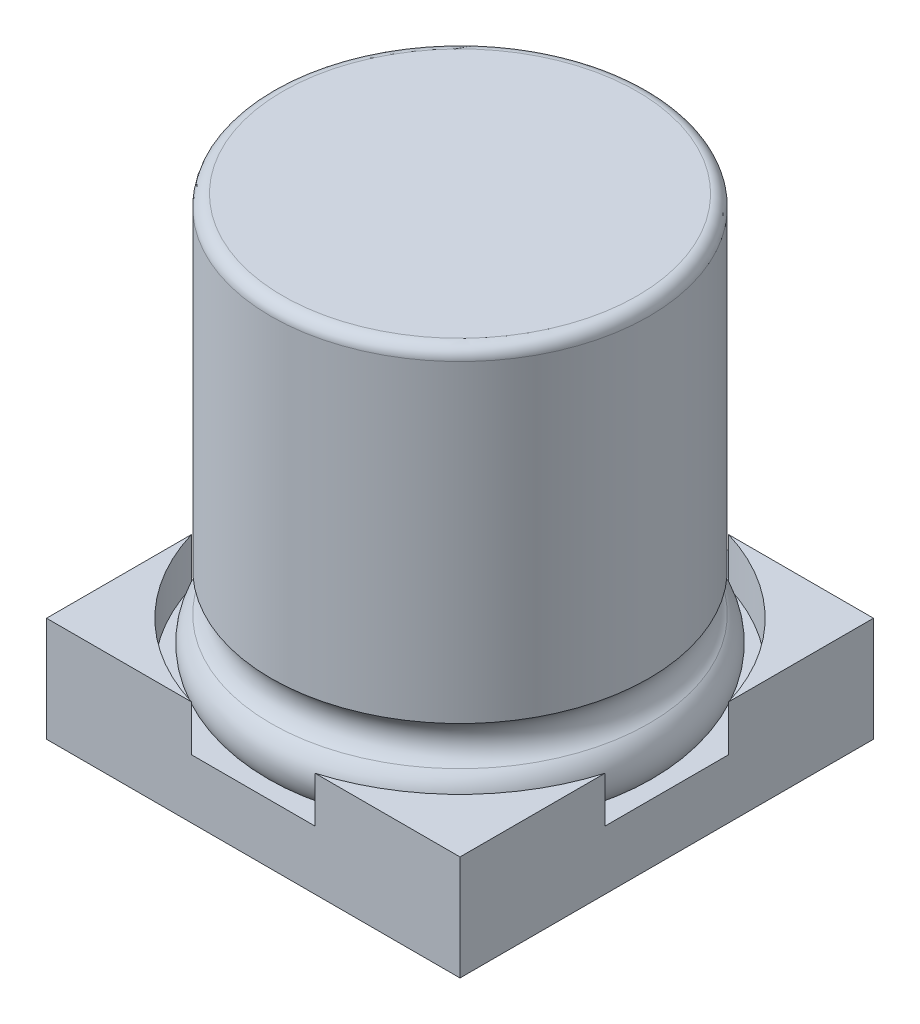
ISO-10303-21;
HEADER;
FILE_DESCRIPTION(('STEP AP214'),'2;1');
FILE_NAME('part.step','',(''),(''),'','','');
FILE_SCHEMA(('AUTOMOTIVE_DESIGN { 1 0 10303 214 1 1 1 1 }'));
ENDSEC;
DATA;
#1=APPLICATION_CONTEXT('core data for automotive mechanical design processes');
#2=APPLICATION_PROTOCOL_DEFINITION('international standard','automotive_design',2000,#1);
#3=PRODUCT_CONTEXT('',#1,'mechanical');
#4=PRODUCT('Part','Part','',(#3));
#5=PRODUCT_RELATED_PRODUCT_CATEGORY('part','',(#4));
#6=PRODUCT_DEFINITION_FORMATION('','',#4);
#7=PRODUCT_DEFINITION_CONTEXT('part definition',#1,'design');
#8=PRODUCT_DEFINITION('design','',#6,#7);
#9=PRODUCT_DEFINITION_SHAPE('','',#8);
#10=(LENGTH_UNIT() NAMED_UNIT(*) SI_UNIT(.MILLI.,.METRE.));
#11=(NAMED_UNIT(*) PLANE_ANGLE_UNIT() SI_UNIT($,.RADIAN.));
#12=(NAMED_UNIT(*) SI_UNIT($,.STERADIAN.) SOLID_ANGLE_UNIT());
#13=UNCERTAINTY_MEASURE_WITH_UNIT(LENGTH_MEASURE(1.E-05),#10,'distance_accuracy_value','');
#14=(GEOMETRIC_REPRESENTATION_CONTEXT(3) GLOBAL_UNCERTAINTY_ASSIGNED_CONTEXT((#13)) GLOBAL_UNIT_ASSIGNED_CONTEXT((#10,
#11,#12)) REPRESENTATION_CONTEXT('',''));
#15=CARTESIAN_POINT('',(0.,0.,0.));
#16=DIRECTION('',(0.,0.,1.));
#17=DIRECTION('',(1.,0.,0.));
#18=AXIS2_PLACEMENT_3D('',#15,#16,#17);
#19=CARTESIAN_POINT('',(0.,0.2,-4.6380085368));
#20=DIRECTION('',(0.,0.,-1.));
#21=DIRECTION('',(-1.,0.,0.));
#22=AXIS2_PLACEMENT_3D('',#19,#20,#21);
#23=PLANE('',#22);
#24=DIRECTION('',(1.,0.,0.));
#25=VECTOR('',#24,1.);
#26=CARTESIAN_POINT('',(-0.6,0.4,-4.6380085368));
#27=LINE('',#26,#25);
#28=CARTESIAN_POINT('',(0.6,0.4,-4.6380085368));
#29=VERTEX_POINT('',#28);
#30=CARTESIAN_POINT('',(-0.6,0.4,-4.6380085368));
#31=VERTEX_POINT('',#30);
#32=EDGE_CURVE('E129',#29,#31,#27,.F.);
#33=ORIENTED_EDGE('',*,*,#32,.F.);
#34=DIRECTION('',(0.,1.,0.));
#35=VECTOR('',#34,1.);
#36=CARTESIAN_POINT('',(0.6,0.4,-4.6380085368));
#37=LINE('',#36,#35);
#38=CARTESIAN_POINT('',(0.6,0.,-4.6380085368));
#39=VERTEX_POINT('',#38);
#40=EDGE_CURVE('E136',#39,#29,#37,.T.);
#41=ORIENTED_EDGE('',*,*,#40,.F.);
#42=DIRECTION('',(1.,0.,0.));
#43=VECTOR('',#42,1.);
#44=CARTESIAN_POINT('',(0.,0.,-4.6380085368));
#45=LINE('',#44,#43);
#46=CARTESIAN_POINT('',(-0.6,0.,-4.6380085368));
#47=VERTEX_POINT('',#46);
#48=EDGE_CURVE('E132',#39,#47,#45,.F.);
#49=ORIENTED_EDGE('',*,*,#48,.T.);
#50=DIRECTION('',(0.,1.,0.));
#51=VECTOR('',#50,1.);
#52=CARTESIAN_POINT('',(-0.6,0.,-4.6380085368));
#53=LINE('',#52,#51);
#54=EDGE_CURVE('E126',#31,#47,#53,.F.);
#55=ORIENTED_EDGE('',*,*,#54,.F.);
#56=EDGE_LOOP('',(#33,#41,#49,#55));
#57=FACE_BOUND('',#56,.T.);
#58=ADVANCED_FACE('F17',(#57),#23,.T.);
#59=CARTESIAN_POINT('',(-0.6,0.,-3.5));
#60=DIRECTION('',(-1.,0.,0.));
#61=DIRECTION('',(0.,0.,1.));
#62=AXIS2_PLACEMENT_3D('',#59,#60,#61);
#63=PLANE('',#62);
#64=ORIENTED_EDGE('',*,*,#54,.T.);
#65=DIRECTION('',(0.,0.,1.));
#66=VECTOR('',#65,1.);
#67=CARTESIAN_POINT('',(-0.6,0.,0.));
#68=LINE('',#67,#66);
#69=CARTESIAN_POINT('',(-0.6,0.,-3.5));
#70=VERTEX_POINT('',#69);
#71=EDGE_CURVE('E210',#47,#70,#68,.T.);
#72=ORIENTED_EDGE('',*,*,#71,.T.);
#73=DIRECTION('',(0.,1.,0.));
#74=VECTOR('',#73,1.);
#75=CARTESIAN_POINT('',(-0.6,0.,-3.5));
#76=LINE('',#75,#74);
#77=CARTESIAN_POINT('',(-0.6,0.4,-3.5));
#78=VERTEX_POINT('',#77);
#79=EDGE_CURVE('E142',#78,#70,#76,.F.);
#80=ORIENTED_EDGE('',*,*,#79,.F.);
#81=DIRECTION('',(0.,0.,1.));
#82=VECTOR('',#81,1.);
#83=CARTESIAN_POINT('',(-0.6,0.4,-3.5));
#84=LINE('',#83,#82);
#85=EDGE_CURVE('E139',#31,#78,#84,.T.);
#86=ORIENTED_EDGE('',*,*,#85,.F.);
#87=EDGE_LOOP('',(#64,#72,#80,#86));
#88=FACE_BOUND('',#87,.T.);
#89=ADVANCED_FACE('F140',(#88),#63,.T.);
#90=CARTESIAN_POINT('',(0.6,0.4,-3.5));
#91=DIRECTION('',(1.,0.,0.));
#92=DIRECTION('',(0.,0.,-1.));
#93=AXIS2_PLACEMENT_3D('',#90,#91,#92);
#94=PLANE('',#93);
#95=ORIENTED_EDGE('',*,*,#40,.T.);
#96=DIRECTION('',(0.,0.,1.));
#97=VECTOR('',#96,1.);
#98=CARTESIAN_POINT('',(0.6,0.4,-3.5));
#99=LINE('',#98,#97);
#100=CARTESIAN_POINT('',(0.6,0.4,-3.5));
#101=VERTEX_POINT('',#100);
#102=EDGE_CURVE('E149',#101,#29,#99,.F.);
#103=ORIENTED_EDGE('',*,*,#102,.F.);
#104=DIRECTION('',(0.,1.,0.));
#105=VECTOR('',#104,1.);
#106=CARTESIAN_POINT('',(0.6,0.,-3.5));
#107=LINE('',#106,#105);
#108=CARTESIAN_POINT('',(0.6,0.,-3.5));
#109=VERTEX_POINT('',#108);
#110=EDGE_CURVE('E196',#109,#101,#107,.T.);
#111=ORIENTED_EDGE('',*,*,#110,.F.);
#112=DIRECTION('',(0.,0.,1.));
#113=VECTOR('',#112,1.);
#114=CARTESIAN_POINT('',(0.6,0.,0.));
#115=LINE('',#114,#113);
#116=EDGE_CURVE('E211',#109,#39,#115,.F.);
#117=ORIENTED_EDGE('',*,*,#116,.T.);
#118=EDGE_LOOP('',(#95,#103,#111,#117));
#119=FACE_BOUND('',#118,.T.);
#120=ADVANCED_FACE('F215',(#119),#94,.T.);
#121=CARTESIAN_POINT('',(-0.6,0.4,-3.5));
#122=DIRECTION('',(0.,1.,0.));
#123=DIRECTION('',(0.,0.,1.));
#124=AXIS2_PLACEMENT_3D('',#121,#122,#123);
#125=PLANE('',#124);
#126=ORIENTED_EDGE('',*,*,#32,.T.);
#127=ORIENTED_EDGE('',*,*,#85,.T.);
#128=DIRECTION('',(-1.,0.,0.));
#129=VECTOR('',#128,1.);
#130=CARTESIAN_POINT('',(3.5,0.4,-3.5));
#131=LINE('',#130,#129);
#132=EDGE_CURVE('E190',#101,#78,#131,.T.);
#133=ORIENTED_EDGE('',*,*,#132,.F.);
#134=ORIENTED_EDGE('',*,*,#102,.T.);
#135=EDGE_LOOP('',(#126,#127,#133,#134));
#136=FACE_BOUND('',#135,.T.);
#137=ADVANCED_FACE('F148',(#136),#125,.T.);
#138=CARTESIAN_POINT('',(-2.27357437807846,1.775,-2.27357437807846));
#139=DIRECTION('',(0.,1.,0.));
#140=DIRECTION('',(0.,0.,1.));
#141=AXIS2_PLACEMENT_3D('',#138,#139,#140);
#142=PLANE('',#141);
#143=DIRECTION('',(0.,0.,1.));
#144=VECTOR('',#143,1.);
#145=CARTESIAN_POINT('',(-3.5,1.775,-2.27357437807846));
#146=LINE('',#145,#144);
#147=CARTESIAN_POINT('',(-3.5,1.775,-2.268));
#148=VERTEX_POINT('',#147);
#149=CARTESIAN_POINT('',(-3.5,1.775,-1.04714875615693));
#150=VERTEX_POINT('',#149);
#151=EDGE_CURVE('E146',#148,#150,#146,.T.);
#152=ORIENTED_EDGE('',*,*,#151,.T.);
#153=CARTESIAN_POINT('',(0.,1.775,0.));
#154=DIRECTION('',(0.,1.,0.));
#155=DIRECTION('',(0.,0.,1.));
#156=AXIS2_PLACEMENT_3D('',#153,#154,#155);
#157=CIRCLE('',#156,3.653289);
#158=CARTESIAN_POINT('',(-1.04714875615693,1.775,-3.5));
#159=VERTEX_POINT('',#158);
#160=EDGE_CURVE('E188',#150,#159,#157,.F.);
#161=ORIENTED_EDGE('',*,*,#160,.T.);
#162=DIRECTION('',(-1.,0.,0.));
#163=VECTOR('',#162,1.);
#164=CARTESIAN_POINT('',(3.5,1.775,-3.5));
#165=LINE('',#164,#163);
#166=CARTESIAN_POINT('',(-2.268,1.775,-3.5));
#167=VERTEX_POINT('',#166);
#168=EDGE_CURVE('E315',#167,#159,#165,.F.);
#169=ORIENTED_EDGE('',*,*,#168,.F.);
#170=DIRECTION('',(-0.707106781186547,0.,0.707106781186548));
#171=VECTOR('',#170,1.);
#172=CARTESIAN_POINT('',(-2.884,1.775,-2.884));
#173=LINE('',#172,#171);
#174=EDGE_CURVE('E99',#148,#167,#173,.F.);
#175=ORIENTED_EDGE('',*,*,#174,.F.);
#176=EDGE_LOOP('',(#152,#161,#169,#175));
#177=FACE_BOUND('',#176,.T.);
#178=ADVANCED_FACE('F341',(#177),#142,.T.);
#179=CARTESIAN_POINT('',(-2.884,0.,-2.884));
#180=DIRECTION('',(-0.707106781186548,0.,-0.707106781186547));
#181=DIRECTION('',(-0.707106781186547,0.,0.707106781186548));
#182=AXIS2_PLACEMENT_3D('',#179,#180,#181);
#183=PLANE('',#182);
#184=DIRECTION('',(0.,1.,0.));
#185=VECTOR('',#184,1.);
#186=CARTESIAN_POINT('',(-3.5,0.,-2.268));
#187=LINE('',#186,#185);
#188=CARTESIAN_POINT('',(-3.5,0.,-2.268));
#189=VERTEX_POINT('',#188);
#190=EDGE_CURVE('E194',#148,#189,#187,.F.);
#191=ORIENTED_EDGE('',*,*,#190,.F.);
#192=ORIENTED_EDGE('',*,*,#174,.T.);
#193=DIRECTION('',(0.,1.,0.));
#194=VECTOR('',#193,1.);
#195=CARTESIAN_POINT('',(-2.268,0.,-3.5));
#196=LINE('',#195,#194);
#197=CARTESIAN_POINT('',(-2.268,0.,-3.5));
#198=VERTEX_POINT('',#197);
#199=EDGE_CURVE('E237',#198,#167,#196,.T.);
#200=ORIENTED_EDGE('',*,*,#199,.F.);
#201=DIRECTION('',(-0.707106781186548,0.,0.707106781186548));
#202=VECTOR('',#201,1.);
#203=CARTESIAN_POINT('',(-2.268,0.,-3.5));
#204=LINE('',#203,#202);
#205=EDGE_CURVE('E225',#198,#189,#204,.T.);
#206=ORIENTED_EDGE('',*,*,#205,.T.);
#207=EDGE_LOOP('',(#191,#192,#200,#206));
#208=FACE_BOUND('',#207,.T.);
#209=ADVANCED_FACE('F331',(#208),#183,.T.);
#210=CARTESIAN_POINT('',(-2.27357437807847,1.775,2.27357437807846));
#211=DIRECTION('',(0.,1.,0.));
#212=DIRECTION('',(0.,0.,1.));
#213=AXIS2_PLACEMENT_3D('',#210,#211,#212);
#214=PLANE('',#213);
#215=DIRECTION('',(1.,0.,0.));
#216=VECTOR('',#215,1.);
#217=CARTESIAN_POINT('',(-3.5,1.775,3.5));
#218=LINE('',#217,#216);
#219=CARTESIAN_POINT('',(-1.04714875615693,1.775,3.5));
#220=VERTEX_POINT('',#219);
#221=CARTESIAN_POINT('',(-3.5,1.775,3.5));
#222=VERTEX_POINT('',#221);
#223=EDGE_CURVE('E286',#220,#222,#218,.F.);
#224=ORIENTED_EDGE('',*,*,#223,.F.);
#225=CARTESIAN_POINT('',(0.,1.775,0.));
#226=DIRECTION('',(0.,1.,0.));
#227=DIRECTION('',(0.,0.,1.));
#228=AXIS2_PLACEMENT_3D('',#225,#226,#227);
#229=CIRCLE('',#228,3.653289);
#230=CARTESIAN_POINT('',(-3.5,1.775,1.04714875615693));
#231=VERTEX_POINT('',#230);
#232=EDGE_CURVE('E185',#220,#231,#229,.F.);
#233=ORIENTED_EDGE('',*,*,#232,.T.);
#234=DIRECTION('',(0.,0.,1.));
#235=VECTOR('',#234,1.);
#236=CARTESIAN_POINT('',(-3.5,1.775,-3.5));
#237=LINE('',#236,#235);
#238=EDGE_CURVE('E296',#222,#231,#237,.F.);
#239=ORIENTED_EDGE('',*,*,#238,.F.);
#240=EDGE_LOOP('',(#224,#233,#239));
#241=FACE_BOUND('',#240,.T.);
#242=ADVANCED_FACE('F349',(#241),#214,.T.);
#243=CARTESIAN_POINT('',(0.,0.,0.));
#244=DIRECTION('',(0.,1.,0.));
#245=DIRECTION('',(0.,0.,1.));
#246=AXIS2_PLACEMENT_3D('',#243,#244,#245);
#247=PLANE('',#246);
#248=DIRECTION('',(-1.,0.,0.));
#249=VECTOR('',#248,1.);
#250=CARTESIAN_POINT('',(3.5,0.,-3.5));
#251=LINE('',#250,#249);
#252=EDGE_CURVE('E224',#70,#198,#251,.T.);
#253=ORIENTED_EDGE('',*,*,#252,.F.);
#254=ORIENTED_EDGE('',*,*,#71,.F.);
#255=ORIENTED_EDGE('',*,*,#48,.F.);
#256=ORIENTED_EDGE('',*,*,#116,.F.);
#257=DIRECTION('',(-1.,0.,0.));
#258=VECTOR('',#257,1.);
#259=CARTESIAN_POINT('',(3.5,0.,-3.5));
#260=LINE('',#259,#258);
#261=CARTESIAN_POINT('',(3.5,0.,-3.5));
#262=VERTEX_POINT('',#261);
#263=EDGE_CURVE('E200',#262,#109,#260,.T.);
#264=ORIENTED_EDGE('',*,*,#263,.F.);
#265=DIRECTION('',(0.,0.,-1.));
#266=VECTOR('',#265,1.);
#267=CARTESIAN_POINT('',(3.5,0.,3.5));
#268=LINE('',#267,#266);
#269=CARTESIAN_POINT('',(3.5,0.,3.5));
#270=VERTEX_POINT('',#269);
#271=EDGE_CURVE('E260',#270,#262,#268,.T.);
#272=ORIENTED_EDGE('',*,*,#271,.F.);
#273=DIRECTION('',(1.,0.,0.));
#274=VECTOR('',#273,1.);
#275=CARTESIAN_POINT('',(-3.5,0.,3.5));
#276=LINE('',#275,#274);
#277=CARTESIAN_POINT('',(-3.5,0.,3.5));
#278=VERTEX_POINT('',#277);
#279=EDGE_CURVE('E280',#278,#270,#276,.T.);
#280=ORIENTED_EDGE('',*,*,#279,.F.);
#281=DIRECTION('',(0.,0.,1.));
#282=VECTOR('',#281,1.);
#283=CARTESIAN_POINT('',(-3.5,0.,-3.5));
#284=LINE('',#283,#282);
#285=EDGE_CURVE('E299',#189,#278,#284,.T.);
#286=ORIENTED_EDGE('',*,*,#285,.F.);
#287=ORIENTED_EDGE('',*,*,#205,.F.);
#288=EDGE_LOOP('',(#253,#254,#255,#256,#264,#272,#280,#286,#287));
#289=FACE_BOUND('',#288,.T.);
#290=ADVANCED_FACE('F222',(#289),#247,.F.);
#291=CARTESIAN_POINT('',(2.27357437807847,1.775,-2.27357437807847));
#292=DIRECTION('',(0.,1.,0.));
#293=DIRECTION('',(0.,0.,1.));
#294=AXIS2_PLACEMENT_3D('',#291,#292,#293);
#295=PLANE('',#294);
#296=DIRECTION('',(-1.,0.,0.));
#297=VECTOR('',#296,1.);
#298=CARTESIAN_POINT('',(3.5,1.775,-3.5));
#299=LINE('',#298,#297);
#300=CARTESIAN_POINT('',(1.04714875615693,1.775,-3.5));
#301=VERTEX_POINT('',#300);
#302=CARTESIAN_POINT('',(3.5,1.775,-3.5));
#303=VERTEX_POINT('',#302);
#304=EDGE_CURVE('E246',#301,#303,#299,.F.);
#305=ORIENTED_EDGE('',*,*,#304,.F.);
#306=CARTESIAN_POINT('',(0.,1.775,0.));
#307=DIRECTION('',(0.,1.,0.));
#308=DIRECTION('',(0.,0.,1.));
#309=AXIS2_PLACEMENT_3D('',#306,#307,#308);
#310=CIRCLE('',#309,3.653289);
#311=CARTESIAN_POINT('',(3.5,1.775,-1.04714875615693));
#312=VERTEX_POINT('',#311);
#313=EDGE_CURVE('E20',#301,#312,#310,.F.);
#314=ORIENTED_EDGE('',*,*,#313,.T.);
#315=DIRECTION('',(0.,0.,-1.));
#316=VECTOR('',#315,1.);
#317=CARTESIAN_POINT('',(3.5,1.775,3.5));
#318=LINE('',#317,#316);
#319=EDGE_CURVE('E243',#303,#312,#318,.F.);
#320=ORIENTED_EDGE('',*,*,#319,.F.);
#321=EDGE_LOOP('',(#305,#314,#320));
#322=FACE_BOUND('',#321,.T.);
#323=ADVANCED_FACE('F240',(#322),#295,.T.);
#324=CARTESIAN_POINT('',(2.27357437807847,1.775,2.27357437807847));
#325=DIRECTION('',(0.,1.,0.));
#326=DIRECTION('',(0.,0.,1.));
#327=AXIS2_PLACEMENT_3D('',#324,#325,#326);
#328=PLANE('',#327);
#329=DIRECTION('',(0.,0.,-1.));
#330=VECTOR('',#329,1.);
#331=CARTESIAN_POINT('',(3.5,1.775,3.5));
#332=LINE('',#331,#330);
#333=CARTESIAN_POINT('',(3.5,1.775,1.04714875615693));
#334=VERTEX_POINT('',#333);
#335=CARTESIAN_POINT('',(3.5,1.775,3.5));
#336=VERTEX_POINT('',#335);
#337=EDGE_CURVE('E421',#334,#336,#332,.F.);
#338=ORIENTED_EDGE('',*,*,#337,.F.);
#339=CARTESIAN_POINT('',(0.,1.775,0.));
#340=DIRECTION('',(0.,1.,0.));
#341=DIRECTION('',(0.,0.,1.));
#342=AXIS2_PLACEMENT_3D('',#339,#340,#341);
#343=CIRCLE('',#342,3.653289);
#344=CARTESIAN_POINT('',(1.04714875615693,1.775,3.5));
#345=VERTEX_POINT('',#344);
#346=EDGE_CURVE('E181',#334,#345,#343,.F.);
#347=ORIENTED_EDGE('',*,*,#346,.T.);
#348=DIRECTION('',(1.,0.,0.));
#349=VECTOR('',#348,1.);
#350=CARTESIAN_POINT('',(-3.5,1.775,3.5));
#351=LINE('',#350,#349);
#352=EDGE_CURVE('E283',#336,#345,#351,.F.);
#353=ORIENTED_EDGE('',*,*,#352,.F.);
#354=EDGE_LOOP('',(#338,#347,#353));
#355=FACE_BOUND('',#354,.T.);
#356=ADVANCED_FACE('F462',(#355),#328,.T.);
#357=CARTESIAN_POINT('',(0.,1.,0.));
#358=DIRECTION('',(0.,1.,0.));
#359=DIRECTION('',(0.,0.,1.));
#360=AXIS2_PLACEMENT_3D('',#357,#358,#359);
#361=CYLINDRICAL_SURFACE('',#360,3.653289);
#362=DIRECTION('',(0.,1.,0.));
#363=VECTOR('',#362,1.);
#364=CARTESIAN_POINT('',(3.5,0.,-1.04714875615693));
#365=LINE('',#364,#363);
#366=CARTESIAN_POINT('',(3.5,1.,-1.04714875615693));
#367=VERTEX_POINT('',#366);
#368=EDGE_CURVE('E249',#312,#367,#365,.F.);
#369=ORIENTED_EDGE('',*,*,#368,.F.);
#370=ORIENTED_EDGE('',*,*,#313,.F.);
#371=DIRECTION('',(0.,1.,0.));
#372=VECTOR('',#371,1.);
#373=CARTESIAN_POINT('',(1.04714875615693,0.,-3.5));
#374=LINE('',#373,#372);
#375=CARTESIAN_POINT('',(1.04714875615693,1.,-3.5));
#376=VERTEX_POINT('',#375);
#377=EDGE_CURVE('E271',#376,#301,#374,.T.);
#378=ORIENTED_EDGE('',*,*,#377,.F.);
#379=CARTESIAN_POINT('',(0.,1.,0.));
#380=DIRECTION('',(0.,1.,0.));
#381=DIRECTION('',(0.,0.,1.));
#382=AXIS2_PLACEMENT_3D('',#379,#380,#381);
#383=CIRCLE('',#382,3.653289);
#384=EDGE_CURVE('E177',#367,#376,#383,.T.);
#385=ORIENTED_EDGE('',*,*,#384,.F.);
#386=EDGE_LOOP('',(#369,#370,#378,#385));
#387=FACE_BOUND('',#386,.T.);
#388=ADVANCED_FACE('F250',(#387),#361,.F.);
#389=CARTESIAN_POINT('',(3.5,0.,-3.5));
#390=DIRECTION('',(0.,0.,-1.));
#391=DIRECTION('',(-1.,0.,0.));
#392=AXIS2_PLACEMENT_3D('',#389,#390,#391);
#393=PLANE('',#392);
#394=ORIENTED_EDGE('',*,*,#110,.T.);
#395=ORIENTED_EDGE('',*,*,#132,.T.);
#396=ORIENTED_EDGE('',*,*,#79,.T.);
#397=ORIENTED_EDGE('',*,*,#252,.T.);
#398=ORIENTED_EDGE('',*,*,#199,.T.);
#399=ORIENTED_EDGE('',*,*,#168,.T.);
#400=DIRECTION('',(0.,1.,0.));
#401=VECTOR('',#400,1.);
#402=CARTESIAN_POINT('',(-1.04714875615693,1.,-3.5));
#403=LINE('',#402,#401);
#404=CARTESIAN_POINT('',(-1.04714875615693,1.,-3.5));
#405=VERTEX_POINT('',#404);
#406=EDGE_CURVE('E189',#159,#405,#403,.F.);
#407=ORIENTED_EDGE('',*,*,#406,.T.);
#408=DIRECTION('',(1.,0.,0.));
#409=VECTOR('',#408,1.);
#410=CARTESIAN_POINT('',(0.,1.,-3.5));
#411=LINE('',#410,#409);
#412=EDGE_CURVE('E176',#376,#405,#411,.F.);
#413=ORIENTED_EDGE('',*,*,#412,.F.);
#414=ORIENTED_EDGE('',*,*,#377,.T.);
#415=ORIENTED_EDGE('',*,*,#304,.T.);
#416=DIRECTION('',(0.,1.,0.));
#417=VECTOR('',#416,1.);
#418=CARTESIAN_POINT('',(3.5,0.,-3.5));
#419=LINE('',#418,#417);
#420=EDGE_CURVE('E258',#262,#303,#419,.T.);
#421=ORIENTED_EDGE('',*,*,#420,.F.);
#422=ORIENTED_EDGE('',*,*,#263,.T.);
#423=EDGE_LOOP('',(#394,#395,#396,#397,#398,#399,#407,#413,#414,#415,#421,#422));
#424=FACE_BOUND('',#423,.T.);
#425=ADVANCED_FACE('F329',(#424),#393,.T.);
#426=CARTESIAN_POINT('',(0.,1.,0.));
#427=DIRECTION('',(0.,1.,0.));
#428=DIRECTION('',(0.,0.,1.));
#429=AXIS2_PLACEMENT_3D('',#426,#427,#428);
#430=CYLINDRICAL_SURFACE('',#429,3.653289);
#431=ORIENTED_EDGE('',*,*,#406,.F.);
#432=ORIENTED_EDGE('',*,*,#160,.F.);
#433=DIRECTION('',(0.,1.,0.));
#434=VECTOR('',#433,1.);
#435=CARTESIAN_POINT('',(-3.5,0.,-1.04714875615693));
#436=LINE('',#435,#434);
#437=CARTESIAN_POINT('',(-3.5,1.,-1.04714875615693));
#438=VERTEX_POINT('',#437);
#439=EDGE_CURVE('E187',#438,#150,#436,.T.);
#440=ORIENTED_EDGE('',*,*,#439,.F.);
#441=CARTESIAN_POINT('',(0.,1.,0.));
#442=DIRECTION('',(0.,1.,0.));
#443=DIRECTION('',(0.,0.,1.));
#444=AXIS2_PLACEMENT_3D('',#441,#442,#443);
#445=CIRCLE('',#444,3.653289);
#446=EDGE_CURVE('E173',#405,#438,#445,.T.);
#447=ORIENTED_EDGE('',*,*,#446,.F.);
#448=EDGE_LOOP('',(#431,#432,#440,#447));
#449=FACE_BOUND('',#448,.T.);
#450=ADVANCED_FACE('F514',(#449),#430,.F.);
#451=CARTESIAN_POINT('',(-3.5,0.,-3.5));
#452=DIRECTION('',(-1.,0.,0.));
#453=DIRECTION('',(0.,0.,1.));
#454=AXIS2_PLACEMENT_3D('',#451,#452,#453);
#455=PLANE('',#454);
#456=ORIENTED_EDGE('',*,*,#439,.T.);
#457=ORIENTED_EDGE('',*,*,#151,.F.);
#458=ORIENTED_EDGE('',*,*,#190,.T.);
#459=ORIENTED_EDGE('',*,*,#285,.T.);
#460=DIRECTION('',(0.,1.,0.));
#461=VECTOR('',#460,1.);
#462=CARTESIAN_POINT('',(-3.5,0.,3.5));
#463=LINE('',#462,#461);
#464=EDGE_CURVE('E184',#222,#278,#463,.F.);
#465=ORIENTED_EDGE('',*,*,#464,.F.);
#466=ORIENTED_EDGE('',*,*,#238,.T.);
#467=DIRECTION('',(0.,1.,0.));
#468=VECTOR('',#467,1.);
#469=CARTESIAN_POINT('',(-3.5,1.,1.04714875615693));
#470=LINE('',#469,#468);
#471=CARTESIAN_POINT('',(-3.5,1.,1.04714875615693));
#472=VERTEX_POINT('',#471);
#473=EDGE_CURVE('E186',#231,#472,#470,.F.);
#474=ORIENTED_EDGE('',*,*,#473,.T.);
#475=DIRECTION('',(0.,0.,1.));
#476=VECTOR('',#475,1.);
#477=CARTESIAN_POINT('',(-3.5,1.,0.));
#478=LINE('',#477,#476);
#479=EDGE_CURVE('E172',#438,#472,#478,.T.);
#480=ORIENTED_EDGE('',*,*,#479,.F.);
#481=EDGE_LOOP('',(#456,#457,#458,#459,#465,#466,#474,#480));
#482=FACE_BOUND('',#481,.T.);
#483=ADVANCED_FACE('F339',(#482),#455,.T.);
#484=CARTESIAN_POINT('',(0.,1.,0.));
#485=DIRECTION('',(0.,1.,0.));
#486=DIRECTION('',(0.,0.,1.));
#487=AXIS2_PLACEMENT_3D('',#484,#485,#486);
#488=CYLINDRICAL_SURFACE('',#487,3.653289);
#489=ORIENTED_EDGE('',*,*,#473,.F.);
#490=ORIENTED_EDGE('',*,*,#232,.F.);
#491=DIRECTION('',(0.,1.,0.));
#492=VECTOR('',#491,1.);
#493=CARTESIAN_POINT('',(-1.04714875615693,0.,3.5));
#494=LINE('',#493,#492);
#495=CARTESIAN_POINT('',(-1.04714875615693,1.,3.5));
#496=VERTEX_POINT('',#495);
#497=EDGE_CURVE('E289',#496,#220,#494,.T.);
#498=ORIENTED_EDGE('',*,*,#497,.F.);
#499=CARTESIAN_POINT('',(0.,1.,0.));
#500=DIRECTION('',(0.,1.,0.));
#501=DIRECTION('',(0.,0.,1.));
#502=AXIS2_PLACEMENT_3D('',#499,#500,#501);
#503=CIRCLE('',#502,3.653289);
#504=EDGE_CURVE('E169',#472,#496,#503,.T.);
#505=ORIENTED_EDGE('',*,*,#504,.F.);
#506=EDGE_LOOP('',(#489,#490,#498,#505));
#507=FACE_BOUND('',#506,.T.);
#508=ADVANCED_FACE('F450',(#507),#488,.F.);
#509=CARTESIAN_POINT('',(-3.5,0.,3.5));
#510=DIRECTION('',(0.,0.,1.));
#511=DIRECTION('',(1.,0.,0.));
#512=AXIS2_PLACEMENT_3D('',#509,#510,#511);
#513=PLANE('',#512);
#514=ORIENTED_EDGE('',*,*,#223,.T.);
#515=ORIENTED_EDGE('',*,*,#464,.T.);
#516=ORIENTED_EDGE('',*,*,#279,.T.);
#517=DIRECTION('',(0.,1.,0.));
#518=VECTOR('',#517,1.);
#519=CARTESIAN_POINT('',(3.5,0.,3.5));
#520=LINE('',#519,#518);
#521=EDGE_CURVE('E180',#336,#270,#520,.F.);
#522=ORIENTED_EDGE('',*,*,#521,.F.);
#523=ORIENTED_EDGE('',*,*,#352,.T.);
#524=DIRECTION('',(0.,1.,0.));
#525=VECTOR('',#524,1.);
#526=CARTESIAN_POINT('',(1.04714875615693,1.,3.5));
#527=LINE('',#526,#525);
#528=CARTESIAN_POINT('',(1.04714875615693,1.,3.5));
#529=VERTEX_POINT('',#528);
#530=EDGE_CURVE('E183',#345,#529,#527,.F.);
#531=ORIENTED_EDGE('',*,*,#530,.T.);
#532=DIRECTION('',(1.,0.,0.));
#533=VECTOR('',#532,1.);
#534=CARTESIAN_POINT('',(0.,1.,3.5));
#535=LINE('',#534,#533);
#536=EDGE_CURVE('E168',#496,#529,#535,.T.);
#537=ORIENTED_EDGE('',*,*,#536,.F.);
#538=ORIENTED_EDGE('',*,*,#497,.T.);
#539=EDGE_LOOP('',(#514,#515,#516,#522,#523,#531,#537,#538));
#540=FACE_BOUND('',#539,.T.);
#541=ADVANCED_FACE('F440',(#540),#513,.T.);
#542=CARTESIAN_POINT('',(0.,1.,0.));
#543=DIRECTION('',(0.,1.,0.));
#544=DIRECTION('',(0.,0.,1.));
#545=AXIS2_PLACEMENT_3D('',#542,#543,#544);
#546=CYLINDRICAL_SURFACE('',#545,3.653289);
#547=ORIENTED_EDGE('',*,*,#530,.F.);
#548=ORIENTED_EDGE('',*,*,#346,.F.);
#549=DIRECTION('',(0.,1.,0.));
#550=VECTOR('',#549,1.);
#551=CARTESIAN_POINT('',(3.5,0.,1.04714875615693));
#552=LINE('',#551,#550);
#553=CARTESIAN_POINT('',(3.5,1.,1.04714875615693));
#554=VERTEX_POINT('',#553);
#555=EDGE_CURVE('E35',#554,#334,#552,.T.);
#556=ORIENTED_EDGE('',*,*,#555,.F.);
#557=CARTESIAN_POINT('',(0.,1.,0.));
#558=DIRECTION('',(0.,1.,0.));
#559=DIRECTION('',(0.,0.,1.));
#560=AXIS2_PLACEMENT_3D('',#557,#558,#559);
#561=CIRCLE('',#560,3.653289);
#562=EDGE_CURVE('E165',#529,#554,#561,.T.);
#563=ORIENTED_EDGE('',*,*,#562,.F.);
#564=EDGE_LOOP('',(#547,#548,#556,#563));
#565=FACE_BOUND('',#564,.T.);
#566=ADVANCED_FACE('F444',(#565),#546,.F.);
#567=CARTESIAN_POINT('',(3.5,0.,3.5));
#568=DIRECTION('',(1.,0.,0.));
#569=DIRECTION('',(0.,0.,-1.));
#570=AXIS2_PLACEMENT_3D('',#567,#568,#569);
#571=PLANE('',#570);
#572=ORIENTED_EDGE('',*,*,#337,.T.);
#573=ORIENTED_EDGE('',*,*,#521,.T.);
#574=ORIENTED_EDGE('',*,*,#271,.T.);
#575=ORIENTED_EDGE('',*,*,#420,.T.);
#576=ORIENTED_EDGE('',*,*,#319,.T.);
#577=ORIENTED_EDGE('',*,*,#368,.T.);
#578=DIRECTION('',(0.,0.,1.));
#579=VECTOR('',#578,1.);
#580=CARTESIAN_POINT('',(3.5,1.,0.));
#581=LINE('',#580,#579);
#582=EDGE_CURVE('E164',#554,#367,#581,.F.);
#583=ORIENTED_EDGE('',*,*,#582,.F.);
#584=ORIENTED_EDGE('',*,*,#555,.T.);
#585=EDGE_LOOP('',(#572,#573,#574,#575,#576,#577,#583,#584));
#586=FACE_BOUND('',#585,.T.);
#587=ADVANCED_FACE('F255',(#586),#571,.T.);
#588=CARTESIAN_POINT('',(0.,1.,0.));
#589=DIRECTION('',(0.,1.,0.));
#590=DIRECTION('',(0.,0.,1.));
#591=AXIS2_PLACEMENT_3D('',#588,#589,#590);
#592=PLANE('',#591);
#593=CARTESIAN_POINT('',(0.,0.999999999999999,0.));
#594=DIRECTION('',(0.,-1.,0.));
#595=DIRECTION('',(1.,0.,0.));
#596=AXIS2_PLACEMENT_3D('',#593,#594,#595);
#597=CIRCLE('',#596,3.20000000000001);
#598=CARTESIAN_POINT('',(3.20000000000001,0.999999999999998,0.));
#599=VERTEX_POINT('',#598);
#600=EDGE_CURVE('E160',#599,#599,#597,.F.);
#601=ORIENTED_EDGE('',*,*,#600,.F.);
#602=EDGE_LOOP('',(#601));
#603=FACE_BOUND('',#602,.T.);
#604=ORIENTED_EDGE('',*,*,#562,.T.);
#605=ORIENTED_EDGE('',*,*,#582,.T.);
#606=ORIENTED_EDGE('',*,*,#384,.T.);
#607=ORIENTED_EDGE('',*,*,#412,.T.);
#608=ORIENTED_EDGE('',*,*,#446,.T.);
#609=ORIENTED_EDGE('',*,*,#479,.T.);
#610=ORIENTED_EDGE('',*,*,#504,.T.);
#611=ORIENTED_EDGE('',*,*,#536,.T.);
#612=EDGE_LOOP('',(#604,#605,#606,#607,#608,#609,#610,#611));
#613=FACE_BOUND('',#612,.T.);
#614=ADVANCED_FACE('F392',(#603,#613),#592,.T.);
#615=CARTESIAN_POINT('',(3.,8.,0.));
#616=DIRECTION('',(0.,1.,0.));
#617=DIRECTION('',(-1.,0.,0.));
#618=AXIS2_PLACEMENT_3D('',#615,#616,#617);
#619=PLANE('',#618);
#620=CARTESIAN_POINT('',(0.,8.,0.));
#621=DIRECTION('',(0.,-1.,0.));
#622=DIRECTION('',(1.,0.,0.));
#623=AXIS2_PLACEMENT_3D('',#620,#621,#622);
#624=CIRCLE('',#623,3.);
#625=CARTESIAN_POINT('',(3.,8.,0.));
#626=VERTEX_POINT('',#625);
#627=EDGE_CURVE('E163',#626,#626,#624,.T.);
#628=ORIENTED_EDGE('',*,*,#627,.F.);
#629=EDGE_LOOP('',(#628));
#630=FACE_BOUND('',#629,.T.);
#631=ADVANCED_FACE('F387',(#630),#619,.T.);
#632=CARTESIAN_POINT('',(0.,1.41556817695327,0.));
#633=DIRECTION('',(0.,-1.,0.));
#634=DIRECTION('',(0.,0.,-1.));
#635=AXIS2_PLACEMENT_3D('',#632,#633,#634);
#636=TOROIDAL_SURFACE('',#635,2.87663642022782,0.526555708752026);
#637=ORIENTED_EDGE('',*,*,#600,.T.);
#638=EDGE_LOOP('',(#637));
#639=FACE_BOUND('',#638,.T.);
#640=CARTESIAN_POINT('',(0.,1.83113635390655,0.));
#641=DIRECTION('',(0.,-1.,0.));
#642=DIRECTION('',(0.,0.,-1.));
#643=AXIS2_PLACEMENT_3D('',#640,#641,#642);
#644=CIRCLE('',#643,3.2);
#645=CARTESIAN_POINT('',(0.,1.83113635390655,-3.2));
#646=VERTEX_POINT('',#645);
#647=EDGE_CURVE('E374',#646,#646,#644,.T.);
#648=ORIENTED_EDGE('',*,*,#647,.T.);
#649=EDGE_LOOP('',(#648));
#650=FACE_BOUND('',#649,.T.);
#651=ADVANCED_FACE('F384',(#639,#650),#636,.T.);
#652=CARTESIAN_POINT('',(0.,7.8,0.));
#653=DIRECTION('',(0.,-1.,0.));
#654=DIRECTION('',(0.,0.,-1.));
#655=AXIS2_PLACEMENT_3D('',#652,#653,#654);
#656=TOROIDAL_SURFACE('',#655,3.,0.2);
#657=CARTESIAN_POINT('',(0.,7.8,0.));
#658=DIRECTION('',(0.,-1.,0.));
#659=DIRECTION('',(1.,0.,0.));
#660=AXIS2_PLACEMENT_3D('',#657,#658,#659);
#661=CIRCLE('',#660,3.2);
#662=CARTESIAN_POINT('',(3.2,7.8,0.));
#663=VERTEX_POINT('',#662);
#664=EDGE_CURVE('E26',#663,#663,#661,.T.);
#665=ORIENTED_EDGE('',*,*,#664,.F.);
#666=EDGE_LOOP('',(#665));
#667=FACE_BOUND('',#666,.T.);
#668=ORIENTED_EDGE('',*,*,#627,.T.);
#669=EDGE_LOOP('',(#668));
#670=FACE_BOUND('',#669,.T.);
#671=ADVANCED_FACE('F360',(#667,#670),#656,.T.);
#672=CARTESIAN_POINT('',(0.,2.1620884566071,0.));
#673=DIRECTION('',(0.,-1.,0.));
#674=DIRECTION('',(0.,0.,-1.));
#675=AXIS2_PLACEMENT_3D('',#672,#673,#674);
#676=TOROIDAL_SURFACE('',#675,3.42497768365847,0.400180274909006);
#677=ORIENTED_EDGE('',*,*,#647,.F.);
#678=EDGE_LOOP('',(#677));
#679=FACE_BOUND('',#678,.T.);
#680=CARTESIAN_POINT('',(0.,2.49304055930765,0.));
#681=DIRECTION('',(0.,-1.,0.));
#682=DIRECTION('',(1.,0.,0.));
#683=AXIS2_PLACEMENT_3D('',#680,#681,#682);
#684=CIRCLE('',#683,3.2);
#685=CARTESIAN_POINT('',(3.2,2.49304055930765,0.));
#686=VERTEX_POINT('',#685);
#687=EDGE_CURVE('E11',#686,#686,#684,.F.);
#688=ORIENTED_EDGE('',*,*,#687,.F.);
#689=EDGE_LOOP('',(#688));
#690=FACE_BOUND('',#689,.T.);
#691=ADVANCED_FACE('F354',(#679,#690),#676,.F.);
#692=CARTESIAN_POINT('',(0.,5.14652027965383,0.));
#693=DIRECTION('',(0.,-1.,0.));
#694=DIRECTION('',(1.,0.,0.));
#695=AXIS2_PLACEMENT_3D('',#692,#693,#694);
#696=CYLINDRICAL_SURFACE('',#695,3.2);
#697=ORIENTED_EDGE('',*,*,#687,.T.);
#698=EDGE_LOOP('',(#697));
#699=FACE_BOUND('',#698,.T.);
#700=ORIENTED_EDGE('',*,*,#664,.T.);
#701=EDGE_LOOP('',(#700));
#702=FACE_BOUND('',#701,.T.);
#703=ADVANCED_FACE('F352',(#699,#702),#696,.T.);
#704=CLOSED_SHELL('',(#58,#89,#120,#137,#178,#209,#242,#290,#323,#356,#388,#425,#450,#483,#508,
#541,#566,#587,#614,#631,#651,#671,#691,#703));
#705=MANIFOLD_SOLID_BREP('B1',#704);
#706=ADVANCED_BREP_SHAPE_REPRESENTATION('',(#18,#705),#14);
#707=SHAPE_DEFINITION_REPRESENTATION(#9,#706);
ENDSEC;
END-ISO-10303-21;
